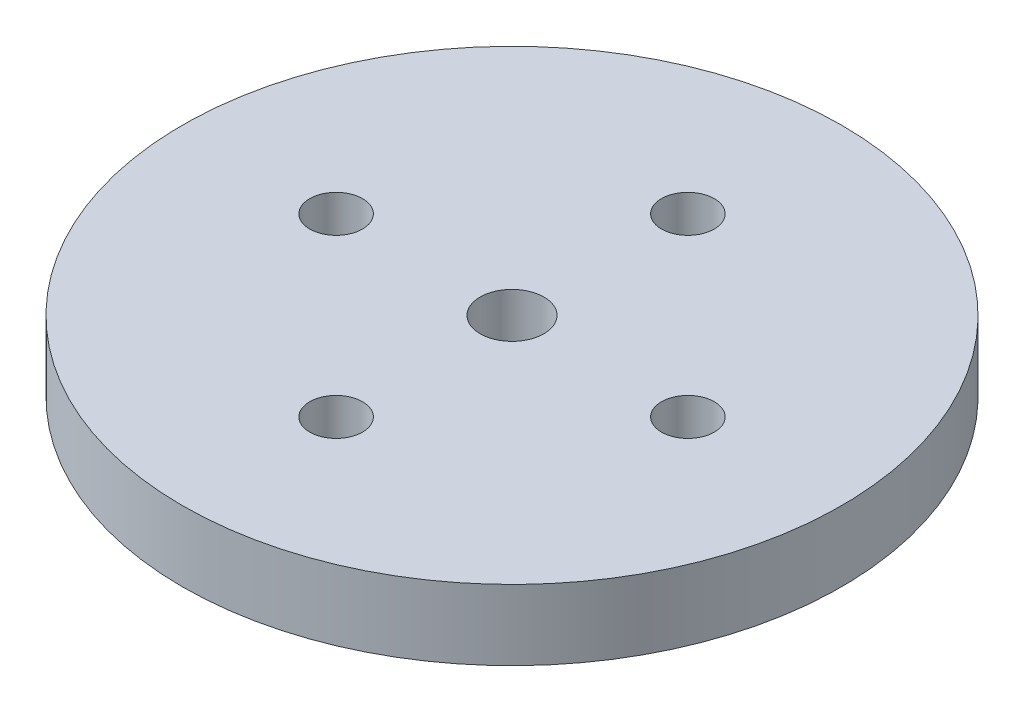
ISO-10303-21;
HEADER;
FILE_DESCRIPTION(('STEP AP214'),'2;1');
FILE_NAME('part.step','',(''),(''),'','','');
FILE_SCHEMA(('AUTOMOTIVE_DESIGN { 1 0 10303 214 1 1 1 1 }'));
ENDSEC;
DATA;
#1=APPLICATION_CONTEXT('core data for automotive mechanical design processes');
#2=APPLICATION_PROTOCOL_DEFINITION('international standard','automotive_design',2000,#1);
#3=PRODUCT_CONTEXT('',#1,'mechanical');
#4=PRODUCT('Part','Part','',(#3));
#5=PRODUCT_RELATED_PRODUCT_CATEGORY('part','',(#4));
#6=PRODUCT_DEFINITION_FORMATION('','',#4);
#7=PRODUCT_DEFINITION_CONTEXT('part definition',#1,'design');
#8=PRODUCT_DEFINITION('design','',#6,#7);
#9=PRODUCT_DEFINITION_SHAPE('','',#8);
#10=(LENGTH_UNIT() NAMED_UNIT(*) SI_UNIT(.MILLI.,.METRE.));
#11=(NAMED_UNIT(*) PLANE_ANGLE_UNIT() SI_UNIT($,.RADIAN.));
#12=(NAMED_UNIT(*) SI_UNIT($,.STERADIAN.) SOLID_ANGLE_UNIT());
#13=UNCERTAINTY_MEASURE_WITH_UNIT(LENGTH_MEASURE(1.E-05),#10,'distance_accuracy_value','');
#14=(GEOMETRIC_REPRESENTATION_CONTEXT(3) GLOBAL_UNCERTAINTY_ASSIGNED_CONTEXT((#13)) GLOBAL_UNIT_ASSIGNED_CONTEXT((#10,
#11,#12)) REPRESENTATION_CONTEXT('',''));
#15=CARTESIAN_POINT('',(0.,0.,0.));
#16=DIRECTION('',(0.,0.,1.));
#17=DIRECTION('',(1.,0.,0.));
#18=AXIS2_PLACEMENT_3D('',#15,#16,#17);
#19=CARTESIAN_POINT('',(0.,3.2,0.));
#20=DIRECTION('',(0.,1.,0.));
#21=DIRECTION('',(0.,0.,1.));
#22=AXIS2_PLACEMENT_3D('',#19,#20,#21);
#23=PLANE('',#22);
#24=CARTESIAN_POINT('',(0.,3.2,8.));
#25=DIRECTION('',(0.,1.,0.));
#26=DIRECTION('',(0.,0.,1.));
#27=AXIS2_PLACEMENT_3D('',#24,#25,#26);
#28=CIRCLE('',#27,1.20000000000005);
#29=CARTESIAN_POINT('',(0.,3.2,9.20000000000005));
#30=VERTEX_POINT('',#29);
#31=EDGE_CURVE('E58',#30,#30,#28,.T.);
#32=ORIENTED_EDGE('',*,*,#31,.F.);
#33=EDGE_LOOP('',(#32));
#34=FACE_BOUND('',#33,.T.);
#35=CARTESIAN_POINT('',(0.,3.2,-8.));
#36=DIRECTION('',(0.,1.,0.));
#37=DIRECTION('',(0.,0.,1.));
#38=AXIS2_PLACEMENT_3D('',#35,#36,#37);
#39=CIRCLE('',#38,1.2);
#40=CARTESIAN_POINT('',(0.,3.2,-6.8));
#41=VERTEX_POINT('',#40);
#42=EDGE_CURVE('E46',#41,#41,#39,.T.);
#43=ORIENTED_EDGE('',*,*,#42,.F.);
#44=EDGE_LOOP('',(#43));
#45=FACE_BOUND('',#44,.T.);
#46=CARTESIAN_POINT('',(0.,3.2,0.));
#47=DIRECTION('',(0.,1.,0.));
#48=DIRECTION('',(0.,0.,1.));
#49=AXIS2_PLACEMENT_3D('',#46,#47,#48);
#50=CIRCLE('',#49,14.99);
#51=CARTESIAN_POINT('',(0.,3.2,14.99));
#52=VERTEX_POINT('',#51);
#53=EDGE_CURVE('E10',#52,#52,#50,.T.);
#54=ORIENTED_EDGE('',*,*,#53,.T.);
#55=EDGE_LOOP('',(#54));
#56=FACE_BOUND('',#55,.T.);
#57=CARTESIAN_POINT('',(0.,3.2,0.));
#58=DIRECTION('',(0.,1.,0.));
#59=DIRECTION('',(0.,0.,1.));
#60=AXIS2_PLACEMENT_3D('',#57,#58,#59);
#61=CIRCLE('',#60,1.45);
#62=CARTESIAN_POINT('',(0.,3.2,1.45));
#63=VERTEX_POINT('',#62);
#64=EDGE_CURVE('E41',#63,#63,#61,.T.);
#65=ORIENTED_EDGE('',*,*,#64,.F.);
#66=EDGE_LOOP('',(#65));
#67=FACE_BOUND('',#66,.T.);
#68=CARTESIAN_POINT('',(8.00000000000023,3.2,-2.26393958003914E-13));
#69=DIRECTION('',(0.,1.,0.));
#70=DIRECTION('',(0.,0.,1.));
#71=AXIS2_PLACEMENT_3D('',#68,#69,#70);
#72=CIRCLE('',#71,1.20000000000018);
#73=CARTESIAN_POINT('',(8.00000000000023,3.2,1.19999999999995));
#74=VERTEX_POINT('',#73);
#75=EDGE_CURVE('E52',#74,#74,#72,.T.);
#76=ORIENTED_EDGE('',*,*,#75,.F.);
#77=EDGE_LOOP('',(#76));
#78=FACE_BOUND('',#77,.T.);
#79=CARTESIAN_POINT('',(-7.99999999999977,3.2,2.27373675443232E-13));
#80=DIRECTION('',(0.,1.,0.));
#81=DIRECTION('',(0.,0.,1.));
#82=AXIS2_PLACEMENT_3D('',#79,#80,#81);
#83=CIRCLE('',#82,1.20000000000036);
#84=CARTESIAN_POINT('',(-7.99999999999977,3.2,1.20000000000059));
#85=VERTEX_POINT('',#84);
#86=EDGE_CURVE('E64',#85,#85,#83,.T.);
#87=ORIENTED_EDGE('',*,*,#86,.F.);
#88=EDGE_LOOP('',(#87));
#89=FACE_BOUND('',#88,.T.);
#90=ADVANCED_FACE('F30',(#34,#45,#56,#67,#78,#89),#23,.T.);
#91=CARTESIAN_POINT('',(0.,0.,0.));
#92=DIRECTION('',(0.,1.,0.));
#93=DIRECTION('',(0.,0.,1.));
#94=AXIS2_PLACEMENT_3D('',#91,#92,#93);
#95=PLANE('',#94);
#96=CARTESIAN_POINT('',(0.,0.,0.));
#97=DIRECTION('',(0.,1.,0.));
#98=DIRECTION('',(0.,0.,1.));
#99=AXIS2_PLACEMENT_3D('',#96,#97,#98);
#100=CIRCLE('',#99,14.99);
#101=CARTESIAN_POINT('',(0.,0.,14.99));
#102=VERTEX_POINT('',#101);
#103=EDGE_CURVE('E34',#102,#102,#100,.T.);
#104=ORIENTED_EDGE('',*,*,#103,.F.);
#105=EDGE_LOOP('',(#104));
#106=FACE_BOUND('',#105,.T.);
#107=CARTESIAN_POINT('',(0.,0.,0.));
#108=DIRECTION('',(0.,1.,0.));
#109=DIRECTION('',(0.,0.,1.));
#110=AXIS2_PLACEMENT_3D('',#107,#108,#109);
#111=CIRCLE('',#110,1.45);
#112=CARTESIAN_POINT('',(0.,0.,1.45));
#113=VERTEX_POINT('',#112);
#114=EDGE_CURVE('E43',#113,#113,#111,.T.);
#115=ORIENTED_EDGE('',*,*,#114,.T.);
#116=EDGE_LOOP('',(#115));
#117=FACE_BOUND('',#116,.T.);
#118=CARTESIAN_POINT('',(0.,0.,-8.));
#119=DIRECTION('',(0.,1.,0.));
#120=DIRECTION('',(0.,0.,1.));
#121=AXIS2_PLACEMENT_3D('',#118,#119,#120);
#122=CIRCLE('',#121,1.2);
#123=CARTESIAN_POINT('',(0.,0.,-6.8));
#124=VERTEX_POINT('',#123);
#125=EDGE_CURVE('E49',#124,#124,#122,.T.);
#126=ORIENTED_EDGE('',*,*,#125,.T.);
#127=EDGE_LOOP('',(#126));
#128=FACE_BOUND('',#127,.T.);
#129=CARTESIAN_POINT('',(8.00000000000023,0.,-2.26393958003914E-13));
#130=DIRECTION('',(0.,1.,0.));
#131=DIRECTION('',(0.,0.,1.));
#132=AXIS2_PLACEMENT_3D('',#129,#130,#131);
#133=CIRCLE('',#132,1.20000000000018);
#134=CARTESIAN_POINT('',(8.00000000000023,0.,1.19999999999995));
#135=VERTEX_POINT('',#134);
#136=EDGE_CURVE('E55',#135,#135,#133,.T.);
#137=ORIENTED_EDGE('',*,*,#136,.T.);
#138=EDGE_LOOP('',(#137));
#139=FACE_BOUND('',#138,.T.);
#140=CARTESIAN_POINT('',(0.,0.,8.));
#141=DIRECTION('',(0.,1.,0.));
#142=DIRECTION('',(0.,0.,1.));
#143=AXIS2_PLACEMENT_3D('',#140,#141,#142);
#144=CIRCLE('',#143,1.20000000000005);
#145=CARTESIAN_POINT('',(0.,0.,9.20000000000005));
#146=VERTEX_POINT('',#145);
#147=EDGE_CURVE('E61',#146,#146,#144,.T.);
#148=ORIENTED_EDGE('',*,*,#147,.T.);
#149=EDGE_LOOP('',(#148));
#150=FACE_BOUND('',#149,.T.);
#151=CARTESIAN_POINT('',(-7.99999999999977,0.,2.27373675443232E-13));
#152=DIRECTION('',(0.,1.,0.));
#153=DIRECTION('',(0.,0.,1.));
#154=AXIS2_PLACEMENT_3D('',#151,#152,#153);
#155=CIRCLE('',#154,1.20000000000036);
#156=CARTESIAN_POINT('',(-7.99999999999977,0.,1.20000000000059));
#157=VERTEX_POINT('',#156);
#158=EDGE_CURVE('E67',#157,#157,#155,.T.);
#159=ORIENTED_EDGE('',*,*,#158,.T.);
#160=EDGE_LOOP('',(#159));
#161=FACE_BOUND('',#160,.T.);
#162=ADVANCED_FACE('F77',(#106,#117,#128,#139,#150,#161),#95,.F.);
#163=CARTESIAN_POINT('',(0.,3.2,0.));
#164=DIRECTION('',(0.,-1.,0.));
#165=DIRECTION('',(0.,0.,-1.));
#166=AXIS2_PLACEMENT_3D('',#163,#164,#165);
#167=CYLINDRICAL_SURFACE('',#166,14.99);
#168=ORIENTED_EDGE('',*,*,#53,.F.);
#169=EDGE_LOOP('',(#168));
#170=FACE_BOUND('',#169,.T.);
#171=ORIENTED_EDGE('',*,*,#103,.T.);
#172=EDGE_LOOP('',(#171));
#173=FACE_BOUND('',#172,.T.);
#174=ADVANCED_FACE('F32',(#170,#173),#167,.T.);
#175=CARTESIAN_POINT('',(0.,3.2,0.));
#176=DIRECTION('',(0.,-1.,0.));
#177=DIRECTION('',(0.,0.,-1.));
#178=AXIS2_PLACEMENT_3D('',#175,#176,#177);
#179=CYLINDRICAL_SURFACE('',#178,1.45);
#180=ORIENTED_EDGE('',*,*,#64,.T.);
#181=EDGE_LOOP('',(#180));
#182=FACE_BOUND('',#181,.T.);
#183=ORIENTED_EDGE('',*,*,#114,.F.);
#184=EDGE_LOOP('',(#183));
#185=FACE_BOUND('',#184,.T.);
#186=ADVANCED_FACE('F87',(#182,#185),#179,.F.);
#187=CARTESIAN_POINT('',(0.,3.2,-8.));
#188=DIRECTION('',(0.,-1.,0.));
#189=DIRECTION('',(0.,0.,-1.));
#190=AXIS2_PLACEMENT_3D('',#187,#188,#189);
#191=CYLINDRICAL_SURFACE('',#190,1.2);
#192=ORIENTED_EDGE('',*,*,#42,.T.);
#193=EDGE_LOOP('',(#192));
#194=FACE_BOUND('',#193,.T.);
#195=ORIENTED_EDGE('',*,*,#125,.F.);
#196=EDGE_LOOP('',(#195));
#197=FACE_BOUND('',#196,.T.);
#198=ADVANCED_FACE('F90',(#194,#197),#191,.F.);
#199=CARTESIAN_POINT('',(8.00000000000023,3.2,-2.26393958003914E-13));
#200=DIRECTION('',(0.,-1.,0.));
#201=DIRECTION('',(0.,0.,-1.));
#202=AXIS2_PLACEMENT_3D('',#199,#200,#201);
#203=CYLINDRICAL_SURFACE('',#202,1.20000000000018);
#204=ORIENTED_EDGE('',*,*,#75,.T.);
#205=EDGE_LOOP('',(#204));
#206=FACE_BOUND('',#205,.T.);
#207=ORIENTED_EDGE('',*,*,#136,.F.);
#208=EDGE_LOOP('',(#207));
#209=FACE_BOUND('',#208,.T.);
#210=ADVANCED_FACE('F94',(#206,#209),#203,.F.);
#211=CARTESIAN_POINT('',(0.,3.2,8.));
#212=DIRECTION('',(0.,-1.,0.));
#213=DIRECTION('',(0.,0.,-1.));
#214=AXIS2_PLACEMENT_3D('',#211,#212,#213);
#215=CYLINDRICAL_SURFACE('',#214,1.20000000000005);
#216=ORIENTED_EDGE('',*,*,#31,.T.);
#217=EDGE_LOOP('',(#216));
#218=FACE_BOUND('',#217,.T.);
#219=ORIENTED_EDGE('',*,*,#147,.F.);
#220=EDGE_LOOP('',(#219));
#221=FACE_BOUND('',#220,.T.);
#222=ADVANCED_FACE('F98',(#218,#221),#215,.F.);
#223=CARTESIAN_POINT('',(-7.99999999999977,3.2,2.27373675443232E-13));
#224=DIRECTION('',(0.,-1.,0.));
#225=DIRECTION('',(0.,0.,-1.));
#226=AXIS2_PLACEMENT_3D('',#223,#224,#225);
#227=CYLINDRICAL_SURFACE('',#226,1.20000000000036);
#228=ORIENTED_EDGE('',*,*,#86,.T.);
#229=EDGE_LOOP('',(#228));
#230=FACE_BOUND('',#229,.T.);
#231=ORIENTED_EDGE('',*,*,#158,.F.);
#232=EDGE_LOOP('',(#231));
#233=FACE_BOUND('',#232,.T.);
#234=ADVANCED_FACE('F73',(#230,#233),#227,.F.);
#235=CLOSED_SHELL('',(#90,#162,#174,#186,#198,#210,#222,#234));
#236=MANIFOLD_SOLID_BREP('B2',#235);
#237=ADVANCED_BREP_SHAPE_REPRESENTATION('',(#18,#236),#14);
#238=SHAPE_DEFINITION_REPRESENTATION(#9,#237);
ENDSEC;
END-ISO-10303-21;
